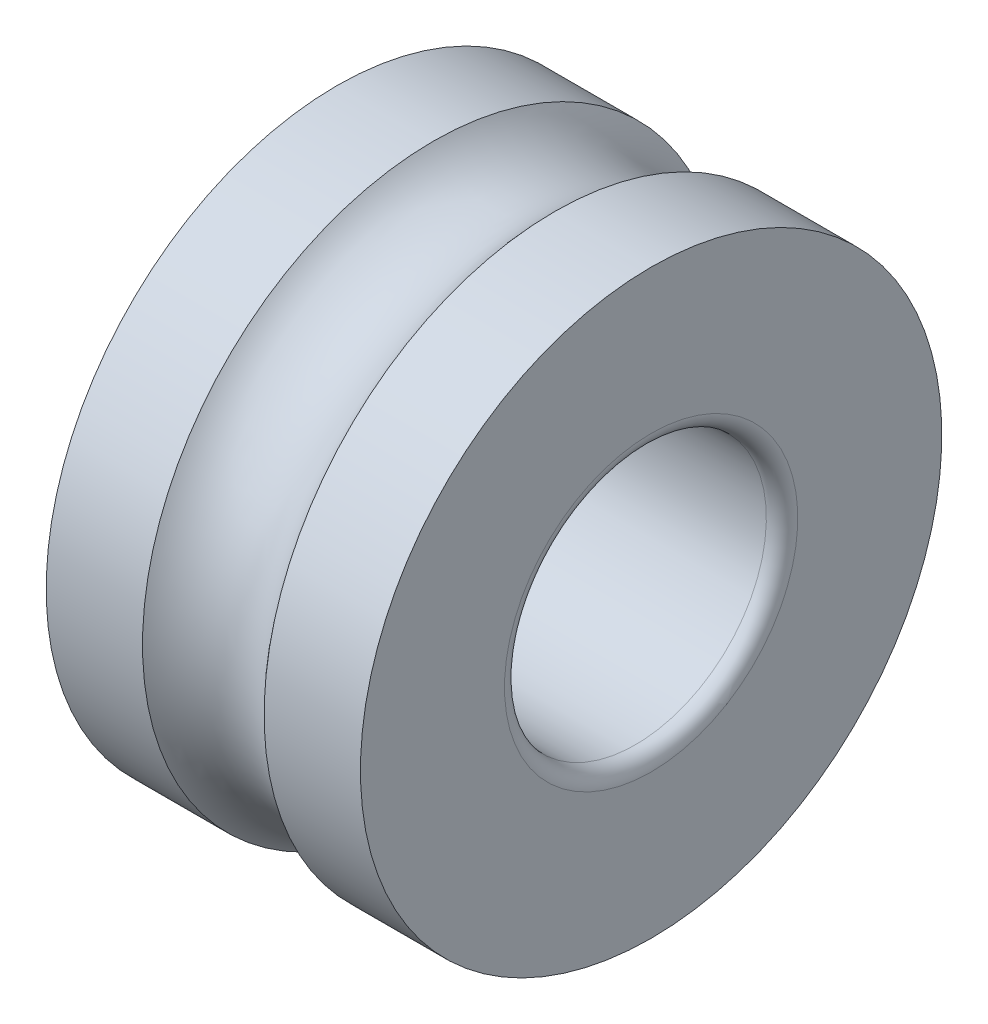
ISO-10303-21;
HEADER;
FILE_DESCRIPTION(('STEP AP214'),'2;1');
FILE_NAME('part.step','',(''),(''),'','','');
FILE_SCHEMA(('AUTOMOTIVE_DESIGN { 1 0 10303 214 1 1 1 1 }'));
ENDSEC;
DATA;
#1=APPLICATION_CONTEXT('core data for automotive mechanical design processes');
#2=APPLICATION_PROTOCOL_DEFINITION('international standard','automotive_design',2000,#1);
#3=PRODUCT_CONTEXT('',#1,'mechanical');
#4=PRODUCT('Part','Part','',(#3));
#5=PRODUCT_RELATED_PRODUCT_CATEGORY('part','',(#4));
#6=PRODUCT_DEFINITION_FORMATION('','',#4);
#7=PRODUCT_DEFINITION_CONTEXT('part definition',#1,'design');
#8=PRODUCT_DEFINITION('design','',#6,#7);
#9=PRODUCT_DEFINITION_SHAPE('','',#8);
#10=(LENGTH_UNIT() NAMED_UNIT(*) SI_UNIT(.MILLI.,.METRE.));
#11=(NAMED_UNIT(*) PLANE_ANGLE_UNIT() SI_UNIT($,.RADIAN.));
#12=(NAMED_UNIT(*) SI_UNIT($,.STERADIAN.) SOLID_ANGLE_UNIT());
#13=UNCERTAINTY_MEASURE_WITH_UNIT(LENGTH_MEASURE(1.E-05),#10,'distance_accuracy_value','');
#14=(GEOMETRIC_REPRESENTATION_CONTEXT(3) GLOBAL_UNCERTAINTY_ASSIGNED_CONTEXT((#13)) GLOBAL_UNIT_ASSIGNED_CONTEXT((#10,
#11,#12)) REPRESENTATION_CONTEXT('',''));
#15=CARTESIAN_POINT('',(0.,0.,0.));
#16=DIRECTION('',(0.,0.,1.));
#17=DIRECTION('',(1.,0.,0.));
#18=AXIS2_PLACEMENT_3D('',#15,#16,#17);
#19=CARTESIAN_POINT('',(5.08040933831219,0.,0.));
#20=DIRECTION('',(-1.,0.,0.));
#21=DIRECTION('',(0.,1.,0.));
#22=AXIS2_PLACEMENT_3D('',#19,#20,#21);
#23=CYLINDRICAL_SURFACE('',#22,5.55);
#24=CARTESIAN_POINT('',(4.16081867662439,0.,0.));
#25=DIRECTION('',(1.,0.,0.));
#26=DIRECTION('',(0.,1.,0.));
#27=AXIS2_PLACEMENT_3D('',#24,#25,#26);
#28=CIRCLE('',#27,5.55);
#29=CARTESIAN_POINT('',(4.16081867662439,5.55,0.));
#30=VERTEX_POINT('',#29);
#31=EDGE_CURVE('E11',#30,#30,#28,.T.);
#32=ORIENTED_EDGE('',*,*,#31,.T.);
#33=EDGE_LOOP('',(#32));
#34=FACE_BOUND('',#33,.T.);
#35=CARTESIAN_POINT('',(6.,0.,0.));
#36=DIRECTION('',(1.,0.,0.));
#37=DIRECTION('',(0.,1.,0.));
#38=AXIS2_PLACEMENT_3D('',#35,#36,#37);
#39=CIRCLE('',#38,5.55);
#40=CARTESIAN_POINT('',(6.,5.55,0.));
#41=VERTEX_POINT('',#40);
#42=EDGE_CURVE('E65',#41,#41,#39,.T.);
#43=ORIENTED_EDGE('',*,*,#42,.F.);
#44=EDGE_LOOP('',(#43));
#45=FACE_BOUND('',#44,.T.);
#46=ADVANCED_FACE('F16',(#34,#45),#23,.T.);
#47=CARTESIAN_POINT('',(3.,0.,0.));
#48=DIRECTION('',(1.,0.,0.));
#49=DIRECTION('',(0.,0.,-1.));
#50=AXIS2_PLACEMENT_3D('',#47,#48,#49);
#51=TOROIDAL_SURFACE('',#50,6.5,1.5);
#52=CARTESIAN_POINT('',(1.83918132337561,0.,0.));
#53=DIRECTION('',(1.,0.,0.));
#54=DIRECTION('',(0.,1.,0.));
#55=AXIS2_PLACEMENT_3D('',#52,#53,#54);
#56=CIRCLE('',#55,5.55);
#57=CARTESIAN_POINT('',(1.83918132337561,5.55,0.));
#58=VERTEX_POINT('',#57);
#59=EDGE_CURVE('E25',#58,#58,#56,.T.);
#60=ORIENTED_EDGE('',*,*,#59,.T.);
#61=EDGE_LOOP('',(#60));
#62=FACE_BOUND('',#61,.T.);
#63=ORIENTED_EDGE('',*,*,#31,.F.);
#64=EDGE_LOOP('',(#63));
#65=FACE_BOUND('',#64,.T.);
#66=ADVANCED_FACE('F83',(#62,#65),#51,.F.);
#67=CARTESIAN_POINT('',(0.919590661687805,0.,0.));
#68=DIRECTION('',(-1.,0.,0.));
#69=DIRECTION('',(0.,1.,0.));
#70=AXIS2_PLACEMENT_3D('',#67,#68,#69);
#71=CYLINDRICAL_SURFACE('',#70,5.55);
#72=CARTESIAN_POINT('',(0.,0.,0.));
#73=DIRECTION('',(1.,0.,0.));
#74=DIRECTION('',(0.,1.,0.));
#75=AXIS2_PLACEMENT_3D('',#72,#73,#74);
#76=CIRCLE('',#75,5.55);
#77=CARTESIAN_POINT('',(0.,5.55,0.));
#78=VERTEX_POINT('',#77);
#79=EDGE_CURVE('E56',#78,#78,#76,.T.);
#80=ORIENTED_EDGE('',*,*,#79,.T.);
#81=EDGE_LOOP('',(#80));
#82=FACE_BOUND('',#81,.T.);
#83=ORIENTED_EDGE('',*,*,#59,.F.);
#84=EDGE_LOOP('',(#83));
#85=FACE_BOUND('',#84,.T.);
#86=ADVANCED_FACE('F18',(#82,#85),#71,.T.);
#87=CARTESIAN_POINT('',(0.,4.175,0.));
#88=DIRECTION('',(-1.,0.,0.));
#89=DIRECTION('',(0.,-1.,0.));
#90=AXIS2_PLACEMENT_3D('',#87,#88,#89);
#91=PLANE('',#90);
#92=CARTESIAN_POINT('',(0.,0.,0.));
#93=DIRECTION('',(1.,0.,0.));
#94=DIRECTION('',(0.,1.,0.));
#95=AXIS2_PLACEMENT_3D('',#92,#93,#94);
#96=CIRCLE('',#95,2.8);
#97=CARTESIAN_POINT('',(0.,2.8,0.));
#98=VERTEX_POINT('',#97);
#99=EDGE_CURVE('E52',#98,#98,#96,.T.);
#100=ORIENTED_EDGE('',*,*,#99,.T.);
#101=EDGE_LOOP('',(#100));
#102=FACE_BOUND('',#101,.T.);
#103=ORIENTED_EDGE('',*,*,#79,.F.);
#104=EDGE_LOOP('',(#103));
#105=FACE_BOUND('',#104,.T.);
#106=ADVANCED_FACE('F53',(#102,#105),#91,.T.);
#107=CARTESIAN_POINT('',(0.3,0.,0.));
#108=DIRECTION('',(1.,0.,0.));
#109=DIRECTION('',(0.,0.,-1.));
#110=AXIS2_PLACEMENT_3D('',#107,#108,#109);
#111=TOROIDAL_SURFACE('',#110,2.8,0.3);
#112=CARTESIAN_POINT('',(0.3,0.,0.));
#113=DIRECTION('',(1.,0.,0.));
#114=DIRECTION('',(0.,1.,0.));
#115=AXIS2_PLACEMENT_3D('',#112,#113,#114);
#116=CIRCLE('',#115,2.5);
#117=CARTESIAN_POINT('',(0.3,2.5,0.));
#118=VERTEX_POINT('',#117);
#119=EDGE_CURVE('E57',#118,#118,#116,.T.);
#120=ORIENTED_EDGE('',*,*,#119,.T.);
#121=EDGE_LOOP('',(#120));
#122=FACE_BOUND('',#121,.T.);
#123=ORIENTED_EDGE('',*,*,#99,.F.);
#124=EDGE_LOOP('',(#123));
#125=FACE_BOUND('',#124,.T.);
#126=ADVANCED_FACE('F92',(#122,#125),#111,.T.);
#127=CARTESIAN_POINT('',(3.,0.,0.));
#128=DIRECTION('',(-1.,0.,0.));
#129=DIRECTION('',(0.,1.,0.));
#130=AXIS2_PLACEMENT_3D('',#127,#128,#129);
#131=CYLINDRICAL_SURFACE('',#130,2.5);
#132=CARTESIAN_POINT('',(5.7,0.,0.));
#133=DIRECTION('',(1.,0.,0.));
#134=DIRECTION('',(0.,1.,0.));
#135=AXIS2_PLACEMENT_3D('',#132,#133,#134);
#136=CIRCLE('',#135,2.5);
#137=CARTESIAN_POINT('',(5.7,2.5,0.));
#138=VERTEX_POINT('',#137);
#139=EDGE_CURVE('E20',#138,#138,#136,.T.);
#140=ORIENTED_EDGE('',*,*,#139,.T.);
#141=EDGE_LOOP('',(#140));
#142=FACE_BOUND('',#141,.T.);
#143=ORIENTED_EDGE('',*,*,#119,.F.);
#144=EDGE_LOOP('',(#143));
#145=FACE_BOUND('',#144,.T.);
#146=ADVANCED_FACE('F79',(#142,#145),#131,.F.);
#147=CARTESIAN_POINT('',(5.7,0.,0.));
#148=DIRECTION('',(1.,0.,0.));
#149=DIRECTION('',(0.,0.,-1.));
#150=AXIS2_PLACEMENT_3D('',#147,#148,#149);
#151=TOROIDAL_SURFACE('',#150,2.8,0.3);
#152=CARTESIAN_POINT('',(6.,0.,0.));
#153=DIRECTION('',(1.,0.,0.));
#154=DIRECTION('',(0.,1.,0.));
#155=AXIS2_PLACEMENT_3D('',#152,#153,#154);
#156=CIRCLE('',#155,2.8);
#157=CARTESIAN_POINT('',(6.,2.8,0.));
#158=VERTEX_POINT('',#157);
#159=EDGE_CURVE('E63',#158,#158,#156,.T.);
#160=ORIENTED_EDGE('',*,*,#159,.T.);
#161=EDGE_LOOP('',(#160));
#162=FACE_BOUND('',#161,.T.);
#163=ORIENTED_EDGE('',*,*,#139,.F.);
#164=EDGE_LOOP('',(#163));
#165=FACE_BOUND('',#164,.T.);
#166=ADVANCED_FACE('F70',(#162,#165),#151,.T.);
#167=CARTESIAN_POINT('',(6.,4.175,0.));
#168=DIRECTION('',(1.,0.,0.));
#169=DIRECTION('',(0.,1.,0.));
#170=AXIS2_PLACEMENT_3D('',#167,#168,#169);
#171=PLANE('',#170);
#172=ORIENTED_EDGE('',*,*,#42,.T.);
#173=EDGE_LOOP('',(#172));
#174=FACE_BOUND('',#173,.T.);
#175=ORIENTED_EDGE('',*,*,#159,.F.);
#176=EDGE_LOOP('',(#175));
#177=FACE_BOUND('',#176,.T.);
#178=ADVANCED_FACE('F73',(#174,#177),#171,.T.);
#179=CLOSED_SHELL('',(#46,#66,#86,#106,#126,#146,#166,#178));
#180=MANIFOLD_SOLID_BREP('B1',#179);
#181=ADVANCED_BREP_SHAPE_REPRESENTATION('',(#18,#180),#14);
#182=SHAPE_DEFINITION_REPRESENTATION(#9,#181);
ENDSEC;
END-ISO-10303-21;
